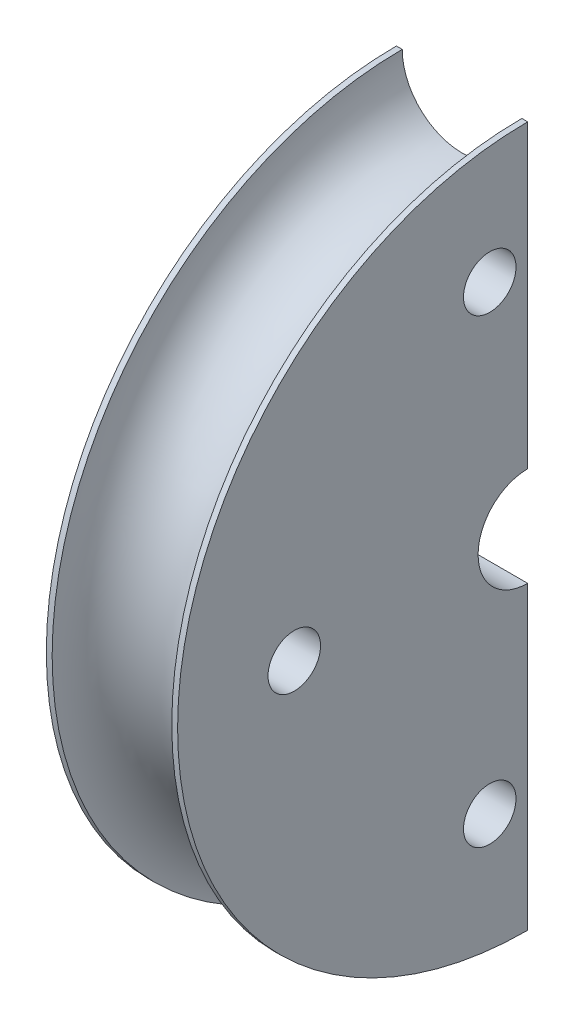
ISO-10303-21;
HEADER;
FILE_DESCRIPTION(('STEP AP214'),'2;1');
FILE_NAME('part.step','',(''),(''),'','','');
FILE_SCHEMA(('AUTOMOTIVE_DESIGN { 1 0 10303 214 1 1 1 1 }'));
ENDSEC;
DATA;
#1=APPLICATION_CONTEXT('core data for automotive mechanical design processes');
#2=APPLICATION_PROTOCOL_DEFINITION('international standard','automotive_design',2000,#1);
#3=PRODUCT_CONTEXT('',#1,'mechanical');
#4=PRODUCT('Part','Part','',(#3));
#5=PRODUCT_RELATED_PRODUCT_CATEGORY('part','',(#4));
#6=PRODUCT_DEFINITION_FORMATION('','',#4);
#7=PRODUCT_DEFINITION_CONTEXT('part definition',#1,'design');
#8=PRODUCT_DEFINITION('design','',#6,#7);
#9=PRODUCT_DEFINITION_SHAPE('','',#8);
#10=(LENGTH_UNIT() NAMED_UNIT(*) SI_UNIT(.MILLI.,.METRE.));
#11=(NAMED_UNIT(*) PLANE_ANGLE_UNIT() SI_UNIT($,.RADIAN.));
#12=(NAMED_UNIT(*) SI_UNIT($,.STERADIAN.) SOLID_ANGLE_UNIT());
#13=UNCERTAINTY_MEASURE_WITH_UNIT(LENGTH_MEASURE(1.E-05),#10,'distance_accuracy_value','');
#14=(GEOMETRIC_REPRESENTATION_CONTEXT(3) GLOBAL_UNCERTAINTY_ASSIGNED_CONTEXT((#13)) GLOBAL_UNIT_ASSIGNED_CONTEXT((#10,
#11,#12)) REPRESENTATION_CONTEXT('',''));
#15=CARTESIAN_POINT('',(0.,0.,0.));
#16=DIRECTION('',(0.,0.,1.));
#17=DIRECTION('',(1.,0.,0.));
#18=AXIS2_PLACEMENT_3D('',#15,#16,#17);
#19=CARTESIAN_POINT('',(0.,0.,0.));
#20=DIRECTION('',(-1.,0.,0.));
#21=DIRECTION('',(0.,0.,1.));
#22=AXIS2_PLACEMENT_3D('',#19,#20,#21);
#23=CYLINDRICAL_SURFACE('',#22,120.);
#24=CARTESIAN_POINT('',(43.,0.,0.));
#25=DIRECTION('',(-1.,0.,0.));
#26=DIRECTION('',(0.,0.,1.));
#27=AXIS2_PLACEMENT_3D('',#24,#25,#26);
#28=CIRCLE('',#27,120.);
#29=CARTESIAN_POINT('',(43.,-120.,-8.37955521322352E-13));
#30=VERTEX_POINT('',#29);
#31=CARTESIAN_POINT('',(43.,120.,0.));
#32=VERTEX_POINT('',#31);
#33=EDGE_CURVE('E11',#30,#32,#28,.T.);
#34=ORIENTED_EDGE('',*,*,#33,.F.);
#35=DIRECTION('',(-1.,0.,0.));
#36=VECTOR('',#35,1.);
#37=CARTESIAN_POINT('',(43.,-120.,-8.37955521322352E-13));
#38=LINE('',#37,#36);
#39=CARTESIAN_POINT('',(45.,-120.,-8.37955521322352E-13));
#40=VERTEX_POINT('',#39);
#41=EDGE_CURVE('E117',#40,#30,#38,.T.);
#42=ORIENTED_EDGE('',*,*,#41,.F.);
#43=CARTESIAN_POINT('',(45.,0.,0.));
#44=DIRECTION('',(-1.,0.,0.));
#45=DIRECTION('',(0.,0.,1.));
#46=AXIS2_PLACEMENT_3D('',#43,#44,#45);
#47=CIRCLE('',#46,120.);
#48=CARTESIAN_POINT('',(45.,120.,0.));
#49=VERTEX_POINT('',#48);
#50=EDGE_CURVE('E49',#40,#49,#47,.T.);
#51=ORIENTED_EDGE('',*,*,#50,.T.);
#52=DIRECTION('',(-1.,0.,0.));
#53=VECTOR('',#52,1.);
#54=CARTESIAN_POINT('',(43.,120.,0.));
#55=LINE('',#54,#53);
#56=EDGE_CURVE('E97',#49,#32,#55,.T.);
#57=ORIENTED_EDGE('',*,*,#56,.T.);
#58=EDGE_LOOP('',(#34,#42,#51,#57));
#59=FACE_BOUND('',#58,.T.);
#60=ADVANCED_FACE('F34',(#59),#23,.T.);
#61=CARTESIAN_POINT('',(22.5,0.,0.));
#62=DIRECTION('',(-1.,0.,0.));
#63=DIRECTION('',(0.,0.,1.));
#64=AXIS2_PLACEMENT_3D('',#61,#62,#63);
#65=TOROIDAL_SURFACE('',#64,120.,20.5);
#66=CARTESIAN_POINT('',(2.,0.,0.));
#67=DIRECTION('',(-1.,0.,0.));
#68=DIRECTION('',(0.,0.,1.));
#69=AXIS2_PLACEMENT_3D('',#66,#67,#68);
#70=CIRCLE('',#69,120.);
#71=CARTESIAN_POINT('',(2.,-120.,-8.37955521322352E-13));
#72=VERTEX_POINT('',#71);
#73=CARTESIAN_POINT('',(2.,120.,0.));
#74=VERTEX_POINT('',#73);
#75=EDGE_CURVE('E42',#72,#74,#70,.T.);
#76=ORIENTED_EDGE('',*,*,#75,.F.);
#77=CARTESIAN_POINT('',(22.5,-120.,-8.37955521322352E-13));
#78=DIRECTION('',(0.,0.,1.));
#79=DIRECTION('',(1.,0.,0.));
#80=AXIS2_PLACEMENT_3D('',#77,#78,#79);
#81=CIRCLE('',#80,20.5);
#82=EDGE_CURVE('E93',#30,#72,#81,.T.);
#83=ORIENTED_EDGE('',*,*,#82,.F.);
#84=ORIENTED_EDGE('',*,*,#33,.T.);
#85=CARTESIAN_POINT('',(22.5,120.,0.));
#86=DIRECTION('',(0.,0.,-1.));
#87=DIRECTION('',(1.,0.,0.));
#88=AXIS2_PLACEMENT_3D('',#85,#86,#87);
#89=CIRCLE('',#88,20.5);
#90=EDGE_CURVE('E90',#32,#74,#89,.T.);
#91=ORIENTED_EDGE('',*,*,#90,.T.);
#92=EDGE_LOOP('',(#76,#83,#84,#91));
#93=FACE_BOUND('',#92,.T.);
#94=ADVANCED_FACE('F36',(#93),#65,.F.);
#95=CARTESIAN_POINT('',(0.,0.,0.));
#96=DIRECTION('',(-1.,0.,0.));
#97=DIRECTION('',(0.,0.,1.));
#98=AXIS2_PLACEMENT_3D('',#95,#96,#97);
#99=CYLINDRICAL_SURFACE('',#98,120.);
#100=CARTESIAN_POINT('',(0.,0.,0.));
#101=DIRECTION('',(-1.,0.,0.));
#102=DIRECTION('',(0.,0.,1.));
#103=AXIS2_PLACEMENT_3D('',#100,#101,#102);
#104=CIRCLE('',#103,120.);
#105=CARTESIAN_POINT('',(0.,-120.,-8.37955521322352E-13));
#106=VERTEX_POINT('',#105);
#107=CARTESIAN_POINT('',(0.,120.,0.));
#108=VERTEX_POINT('',#107);
#109=EDGE_CURVE('E135',#106,#108,#104,.T.);
#110=ORIENTED_EDGE('',*,*,#109,.F.);
#111=DIRECTION('',(-1.,0.,0.));
#112=VECTOR('',#111,1.);
#113=CARTESIAN_POINT('',(0.,-120.,-8.37955521322352E-13));
#114=LINE('',#113,#112);
#115=EDGE_CURVE('E120',#72,#106,#114,.T.);
#116=ORIENTED_EDGE('',*,*,#115,.F.);
#117=ORIENTED_EDGE('',*,*,#75,.T.);
#118=DIRECTION('',(-1.,0.,0.));
#119=VECTOR('',#118,1.);
#120=CARTESIAN_POINT('',(0.,120.,0.));
#121=LINE('',#120,#119);
#122=EDGE_CURVE('E105',#74,#108,#121,.T.);
#123=ORIENTED_EDGE('',*,*,#122,.T.);
#124=EDGE_LOOP('',(#110,#116,#117,#123));
#125=FACE_BOUND('',#124,.T.);
#126=ADVANCED_FACE('F138',(#125),#99,.T.);
#127=CARTESIAN_POINT('',(0.,-17.,-1.18710365520667E-13));
#128=DIRECTION('',(1.,0.,0.));
#129=DIRECTION('',(0.,0.,-1.));
#130=AXIS2_PLACEMENT_3D('',#127,#128,#129);
#131=PLANE('',#130);
#132=CARTESIAN_POINT('',(0.,-78.9366834874637,12.9999999999992));
#133=DIRECTION('',(-1.,0.,0.));
#134=DIRECTION('',(0.,0.,1.));
#135=AXIS2_PLACEMENT_3D('',#132,#133,#134);
#136=CIRCLE('',#135,9.00000000000002);
#137=CARTESIAN_POINT('',(0.,-78.9366834874637,21.9999999999992));
#138=VERTEX_POINT('',#137);
#139=EDGE_CURVE('E189',#138,#138,#136,.T.);
#140=ORIENTED_EDGE('',*,*,#139,.F.);
#141=EDGE_LOOP('',(#140));
#142=FACE_BOUND('',#141,.T.);
#143=CARTESIAN_POINT('',(0.,78.9366834874636,13.));
#144=DIRECTION('',(-1.,0.,0.));
#145=DIRECTION('',(0.,0.,1.));
#146=AXIS2_PLACEMENT_3D('',#143,#144,#145);
#147=CIRCLE('',#146,9.);
#148=CARTESIAN_POINT('',(0.,78.9366834874636,22.));
#149=VERTEX_POINT('',#148);
#150=EDGE_CURVE('E185',#149,#149,#147,.T.);
#151=ORIENTED_EDGE('',*,*,#150,.F.);
#152=EDGE_LOOP('',(#151));
#153=FACE_BOUND('',#152,.T.);
#154=CARTESIAN_POINT('',(0.,0.,80.));
#155=DIRECTION('',(-1.,0.,0.));
#156=DIRECTION('',(0.,0.,1.));
#157=AXIS2_PLACEMENT_3D('',#154,#155,#156);
#158=CIRCLE('',#157,9.00000000000001);
#159=CARTESIAN_POINT('',(0.,0.,89.));
#160=VERTEX_POINT('',#159);
#161=EDGE_CURVE('E181',#160,#160,#158,.T.);
#162=ORIENTED_EDGE('',*,*,#161,.F.);
#163=EDGE_LOOP('',(#162));
#164=FACE_BOUND('',#163,.T.);
#165=CARTESIAN_POINT('',(0.,0.,0.));
#166=DIRECTION('',(-1.,0.,0.));
#167=DIRECTION('',(0.,0.,1.));
#168=AXIS2_PLACEMENT_3D('',#165,#166,#167);
#169=CIRCLE('',#168,17.);
#170=CARTESIAN_POINT('',(0.,-17.,-1.18710365520667E-13));
#171=VERTEX_POINT('',#170);
#172=CARTESIAN_POINT('',(0.,17.,0.));
#173=VERTEX_POINT('',#172);
#174=EDGE_CURVE('E133',#171,#173,#169,.T.);
#175=ORIENTED_EDGE('',*,*,#174,.F.);
#176=DIRECTION('',(0.,1.,0.));
#177=VECTOR('',#176,1.);
#178=CARTESIAN_POINT('',(0.,-17.,-1.18710365520667E-13));
#179=LINE('',#178,#177);
#180=EDGE_CURVE('E123',#106,#171,#179,.T.);
#181=ORIENTED_EDGE('',*,*,#180,.F.);
#182=ORIENTED_EDGE('',*,*,#109,.T.);
#183=DIRECTION('',(0.,-1.,0.));
#184=VECTOR('',#183,1.);
#185=CARTESIAN_POINT('',(0.,17.,0.));
#186=LINE('',#185,#184);
#187=EDGE_CURVE('E107',#108,#173,#186,.T.);
#188=ORIENTED_EDGE('',*,*,#187,.T.);
#189=EDGE_LOOP('',(#175,#181,#182,#188));
#190=FACE_BOUND('',#189,.T.);
#191=ADVANCED_FACE('F146',(#142,#153,#164,#190),#131,.F.);
#192=CARTESIAN_POINT('',(0.,0.,0.));
#193=DIRECTION('',(-1.,0.,0.));
#194=DIRECTION('',(0.,0.,1.));
#195=AXIS2_PLACEMENT_3D('',#192,#193,#194);
#196=CYLINDRICAL_SURFACE('',#195,17.);
#197=CARTESIAN_POINT('',(45.,0.,0.));
#198=DIRECTION('',(-1.,0.,0.));
#199=DIRECTION('',(0.,0.,1.));
#200=AXIS2_PLACEMENT_3D('',#197,#198,#199);
#201=CIRCLE('',#200,17.);
#202=CARTESIAN_POINT('',(45.,-17.,-1.18710365520667E-13));
#203=VERTEX_POINT('',#202);
#204=CARTESIAN_POINT('',(45.,17.,0.));
#205=VERTEX_POINT('',#204);
#206=EDGE_CURVE('E57',#203,#205,#201,.T.);
#207=ORIENTED_EDGE('',*,*,#206,.F.);
#208=DIRECTION('',(1.,0.,0.));
#209=VECTOR('',#208,1.);
#210=CARTESIAN_POINT('',(0.,-17.,-1.18710365520667E-13));
#211=LINE('',#210,#209);
#212=EDGE_CURVE('E126',#171,#203,#211,.T.);
#213=ORIENTED_EDGE('',*,*,#212,.F.);
#214=ORIENTED_EDGE('',*,*,#174,.T.);
#215=DIRECTION('',(1.,0.,0.));
#216=VECTOR('',#215,1.);
#217=CARTESIAN_POINT('',(0.,17.,0.));
#218=LINE('',#217,#216);
#219=EDGE_CURVE('E113',#173,#205,#218,.T.);
#220=ORIENTED_EDGE('',*,*,#219,.T.);
#221=EDGE_LOOP('',(#207,#213,#214,#220));
#222=FACE_BOUND('',#221,.T.);
#223=ADVANCED_FACE('F144',(#222),#196,.F.);
#224=CARTESIAN_POINT('',(45.,-120.,-8.37955521322352E-13));
#225=DIRECTION('',(-1.,0.,0.));
#226=DIRECTION('',(0.,0.,1.));
#227=AXIS2_PLACEMENT_3D('',#224,#225,#226);
#228=PLANE('',#227);
#229=CARTESIAN_POINT('',(45.,-78.9366834874637,12.9999999999992));
#230=DIRECTION('',(-1.,0.,0.));
#231=DIRECTION('',(0.,0.,1.));
#232=AXIS2_PLACEMENT_3D('',#229,#230,#231);
#233=CIRCLE('',#232,9.00000000000002);
#234=CARTESIAN_POINT('',(45.,-78.9366834874637,21.9999999999992));
#235=VERTEX_POINT('',#234);
#236=EDGE_CURVE('E173',#235,#235,#233,.T.);
#237=ORIENTED_EDGE('',*,*,#236,.T.);
#238=EDGE_LOOP('',(#237));
#239=FACE_BOUND('',#238,.T.);
#240=CARTESIAN_POINT('',(45.,78.9366834874636,13.));
#241=DIRECTION('',(-1.,0.,0.));
#242=DIRECTION('',(0.,0.,1.));
#243=AXIS2_PLACEMENT_3D('',#240,#241,#242);
#244=CIRCLE('',#243,9.);
#245=CARTESIAN_POINT('',(45.,78.9366834874636,22.));
#246=VERTEX_POINT('',#245);
#247=EDGE_CURVE('E177',#246,#246,#244,.T.);
#248=ORIENTED_EDGE('',*,*,#247,.T.);
#249=EDGE_LOOP('',(#248));
#250=FACE_BOUND('',#249,.T.);
#251=CARTESIAN_POINT('',(45.,0.,80.));
#252=DIRECTION('',(-1.,0.,0.));
#253=DIRECTION('',(0.,0.,1.));
#254=AXIS2_PLACEMENT_3D('',#251,#252,#253);
#255=CIRCLE('',#254,9.00000000000001);
#256=CARTESIAN_POINT('',(45.,0.,89.));
#257=VERTEX_POINT('',#256);
#258=EDGE_CURVE('E100',#257,#257,#255,.T.);
#259=ORIENTED_EDGE('',*,*,#258,.T.);
#260=EDGE_LOOP('',(#259));
#261=FACE_BOUND('',#260,.T.);
#262=DIRECTION('',(0.,-1.,0.));
#263=VECTOR('',#262,1.);
#264=CARTESIAN_POINT('',(45.,-120.,-8.37955521322352E-13));
#265=LINE('',#264,#263);
#266=EDGE_CURVE('E128',#203,#40,#265,.T.);
#267=ORIENTED_EDGE('',*,*,#266,.F.);
#268=ORIENTED_EDGE('',*,*,#206,.T.);
#269=DIRECTION('',(0.,1.,0.));
#270=VECTOR('',#269,1.);
#271=CARTESIAN_POINT('',(45.,120.,0.));
#272=LINE('',#271,#270);
#273=EDGE_CURVE('E115',#205,#49,#272,.T.);
#274=ORIENTED_EDGE('',*,*,#273,.T.);
#275=ORIENTED_EDGE('',*,*,#50,.F.);
#276=EDGE_LOOP('',(#267,#268,#274,#275));
#277=FACE_BOUND('',#276,.T.);
#278=ADVANCED_FACE('F142',(#239,#250,#261,#277),#228,.F.);
#279=CARTESIAN_POINT('',(22.5,-120.,-8.37955521322352E-13));
#280=DIRECTION('',(0.,0.,-1.));
#281=DIRECTION('',(1.,0.,0.));
#282=AXIS2_PLACEMENT_3D('',#279,#280,#281);
#283=PLANE('',#282);
#284=ORIENTED_EDGE('',*,*,#41,.T.);
#285=ORIENTED_EDGE('',*,*,#82,.T.);
#286=ORIENTED_EDGE('',*,*,#115,.T.);
#287=ORIENTED_EDGE('',*,*,#180,.T.);
#288=ORIENTED_EDGE('',*,*,#212,.T.);
#289=ORIENTED_EDGE('',*,*,#266,.T.);
#290=EDGE_LOOP('',(#284,#285,#286,#287,#288,#289));
#291=FACE_BOUND('',#290,.T.);
#292=ADVANCED_FACE('F140',(#291),#283,.T.);
#293=CARTESIAN_POINT('',(22.5,120.,0.));
#294=DIRECTION('',(0.,0.,1.));
#295=DIRECTION('',(1.,0.,0.));
#296=AXIS2_PLACEMENT_3D('',#293,#294,#295);
#297=PLANE('',#296);
#298=ORIENTED_EDGE('',*,*,#56,.F.);
#299=ORIENTED_EDGE('',*,*,#273,.F.);
#300=ORIENTED_EDGE('',*,*,#219,.F.);
#301=ORIENTED_EDGE('',*,*,#187,.F.);
#302=ORIENTED_EDGE('',*,*,#122,.F.);
#303=ORIENTED_EDGE('',*,*,#90,.F.);
#304=EDGE_LOOP('',(#298,#299,#300,#301,#302,#303));
#305=FACE_BOUND('',#304,.T.);
#306=ADVANCED_FACE('F102',(#305),#297,.F.);
#307=CARTESIAN_POINT('',(45.,0.,80.));
#308=DIRECTION('',(-1.,0.,0.));
#309=DIRECTION('',(0.,0.,1.));
#310=AXIS2_PLACEMENT_3D('',#307,#308,#309);
#311=CYLINDRICAL_SURFACE('',#310,9.00000000000001);
#312=ORIENTED_EDGE('',*,*,#258,.F.);
#313=EDGE_LOOP('',(#312));
#314=FACE_BOUND('',#313,.T.);
#315=ORIENTED_EDGE('',*,*,#161,.T.);
#316=EDGE_LOOP('',(#315));
#317=FACE_BOUND('',#316,.T.);
#318=ADVANCED_FACE('F201',(#314,#317),#311,.F.);
#319=CARTESIAN_POINT('',(45.,78.9366834874636,13.));
#320=DIRECTION('',(-1.,0.,0.));
#321=DIRECTION('',(0.,0.,1.));
#322=AXIS2_PLACEMENT_3D('',#319,#320,#321);
#323=CYLINDRICAL_SURFACE('',#322,9.);
#324=ORIENTED_EDGE('',*,*,#247,.F.);
#325=EDGE_LOOP('',(#324));
#326=FACE_BOUND('',#325,.T.);
#327=ORIENTED_EDGE('',*,*,#150,.T.);
#328=EDGE_LOOP('',(#327));
#329=FACE_BOUND('',#328,.T.);
#330=ADVANCED_FACE('F195',(#326,#329),#323,.F.);
#331=CARTESIAN_POINT('',(45.,-78.9366834874637,12.9999999999992));
#332=DIRECTION('',(-1.,0.,0.));
#333=DIRECTION('',(0.,0.,1.));
#334=AXIS2_PLACEMENT_3D('',#331,#332,#333);
#335=CYLINDRICAL_SURFACE('',#334,9.00000000000002);
#336=ORIENTED_EDGE('',*,*,#236,.F.);
#337=EDGE_LOOP('',(#336));
#338=FACE_BOUND('',#337,.T.);
#339=ORIENTED_EDGE('',*,*,#139,.T.);
#340=EDGE_LOOP('',(#339));
#341=FACE_BOUND('',#340,.T.);
#342=ADVANCED_FACE('F193',(#338,#341),#335,.F.);
#343=CLOSED_SHELL('',(#60,#94,#126,#191,#223,#278,#292,#306,#318,#330,#342));
#344=MANIFOLD_SOLID_BREP('B2',#343);
#345=ADVANCED_BREP_SHAPE_REPRESENTATION('',(#18,#344),#14);
#346=SHAPE_DEFINITION_REPRESENTATION(#9,#345);
ENDSEC;
END-ISO-10303-21;
